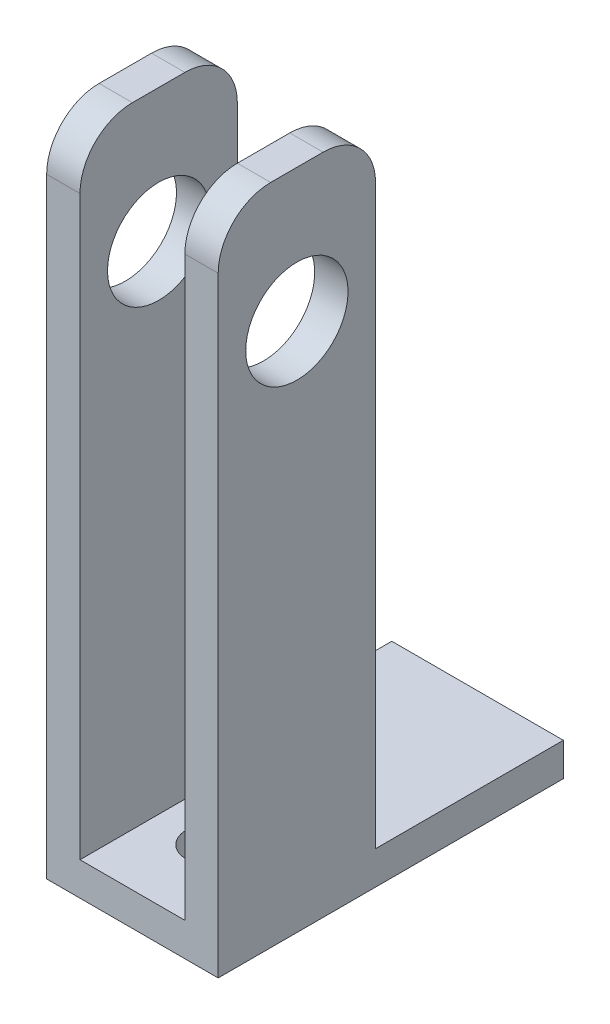
ISO-10303-21;
HEADER;
FILE_DESCRIPTION(('STEP AP214'),'2;1');
FILE_NAME('part.step','',(''),(''),'','','');
FILE_SCHEMA(('AUTOMOTIVE_DESIGN { 1 0 10303 214 1 1 1 1 }'));
ENDSEC;
DATA;
#1=APPLICATION_CONTEXT('core data for automotive mechanical design processes');
#2=APPLICATION_PROTOCOL_DEFINITION('international standard','automotive_design',2000,#1);
#3=PRODUCT_CONTEXT('',#1,'mechanical');
#4=PRODUCT('Part','Part','',(#3));
#5=PRODUCT_RELATED_PRODUCT_CATEGORY('part','',(#4));
#6=PRODUCT_DEFINITION_FORMATION('','',#4);
#7=PRODUCT_DEFINITION_CONTEXT('part definition',#1,'design');
#8=PRODUCT_DEFINITION('design','',#6,#7);
#9=PRODUCT_DEFINITION_SHAPE('','',#8);
#10=(LENGTH_UNIT() NAMED_UNIT(*) SI_UNIT(.MILLI.,.METRE.));
#11=(NAMED_UNIT(*) PLANE_ANGLE_UNIT() SI_UNIT($,.RADIAN.));
#12=(NAMED_UNIT(*) SI_UNIT($,.STERADIAN.) SOLID_ANGLE_UNIT());
#13=UNCERTAINTY_MEASURE_WITH_UNIT(LENGTH_MEASURE(1.E-05),#10,'distance_accuracy_value','');
#14=(GEOMETRIC_REPRESENTATION_CONTEXT(3) GLOBAL_UNCERTAINTY_ASSIGNED_CONTEXT((#13)) GLOBAL_UNIT_ASSIGNED_CONTEXT((#10,
#11,#12)) REPRESENTATION_CONTEXT('',''));
#15=CARTESIAN_POINT('',(0.,0.,0.));
#16=DIRECTION('',(0.,0.,1.));
#17=DIRECTION('',(1.,0.,0.));
#18=AXIS2_PLACEMENT_3D('',#15,#16,#17);
#19=CARTESIAN_POINT('',(-10.,0.,-15.));
#20=DIRECTION('',(0.,0.,-1.));
#21=DIRECTION('',(-1.,0.,0.));
#22=AXIS2_PLACEMENT_3D('',#19,#20,#21);
#23=PLANE('',#22);
#24=DIRECTION('',(0.,1.,0.));
#25=VECTOR('',#24,1.);
#26=CARTESIAN_POINT('',(16.35,0.,-15.));
#27=LINE('',#26,#25);
#28=CARTESIAN_POINT('',(16.35,6.35,-15.));
#29=VERTEX_POINT('',#28);
#30=CARTESIAN_POINT('',(16.35,116.35,-15.));
#31=VERTEX_POINT('',#30);
#32=EDGE_CURVE('E53',#29,#31,#27,.T.);
#33=ORIENTED_EDGE('',*,*,#32,.F.);
#34=DIRECTION('',(-1.,0.,0.));
#35=VECTOR('',#34,1.);
#36=CARTESIAN_POINT('',(-16.35,6.35,-15.));
#37=LINE('',#36,#35);
#38=CARTESIAN_POINT('',(10.,6.35,-15.));
#39=VERTEX_POINT('',#38);
#40=EDGE_CURVE('E152',#29,#39,#37,.T.);
#41=ORIENTED_EDGE('',*,*,#40,.T.);
#42=DIRECTION('',(0.,1.,0.));
#43=VECTOR('',#42,1.);
#44=CARTESIAN_POINT('',(10.,0.,-15.));
#45=LINE('',#44,#43);
#46=CARTESIAN_POINT('',(10.,116.35,-15.));
#47=VERTEX_POINT('',#46);
#48=EDGE_CURVE('E217',#39,#47,#45,.T.);
#49=ORIENTED_EDGE('',*,*,#48,.T.);
#50=DIRECTION('',(-1.,0.,0.));
#51=VECTOR('',#50,1.);
#52=CARTESIAN_POINT('',(-10.,116.35,-15.));
#53=LINE('',#52,#51);
#54=EDGE_CURVE('E249',#47,#31,#53,.F.);
#55=ORIENTED_EDGE('',*,*,#54,.T.);
#56=EDGE_LOOP('',(#33,#41,#49,#55));
#57=FACE_BOUND('',#56,.T.);
#58=ADVANCED_FACE('F38',(#57),#23,.T.);
#59=DIRECTION('',(0.,1.,0.));
#60=VECTOR('',#59,1.);
#61=CARTESIAN_POINT('',(-10.,0.,-15.));
#62=LINE('',#61,#60);
#63=CARTESIAN_POINT('',(-10.,6.35,-15.));
#64=VERTEX_POINT('',#63);
#65=CARTESIAN_POINT('',(-10.,116.35,-15.));
#66=VERTEX_POINT('',#65);
#67=EDGE_CURVE('E204',#64,#66,#62,.T.);
#68=ORIENTED_EDGE('',*,*,#67,.F.);
#69=CARTESIAN_POINT('',(-16.35,6.35,-15.));
#70=VERTEX_POINT('',#69);
#71=EDGE_CURVE('E172',#64,#70,#37,.T.);
#72=ORIENTED_EDGE('',*,*,#71,.T.);
#73=DIRECTION('',(0.,1.,0.));
#74=VECTOR('',#73,1.);
#75=CARTESIAN_POINT('',(-16.35,0.,-15.));
#76=LINE('',#75,#74);
#77=CARTESIAN_POINT('',(-16.35,116.35,-15.));
#78=VERTEX_POINT('',#77);
#79=EDGE_CURVE('E166',#70,#78,#76,.T.);
#80=ORIENTED_EDGE('',*,*,#79,.T.);
#81=DIRECTION('',(-1.,0.,0.));
#82=VECTOR('',#81,1.);
#83=CARTESIAN_POINT('',(-10.,116.35,-15.));
#84=LINE('',#83,#82);
#85=EDGE_CURVE('E247',#78,#66,#84,.F.);
#86=ORIENTED_EDGE('',*,*,#85,.T.);
#87=EDGE_LOOP('',(#68,#72,#80,#86));
#88=FACE_BOUND('',#87,.T.);
#89=ADVANCED_FACE('F274',(#88),#23,.T.);
#90=CARTESIAN_POINT('',(0.,0.,0.));
#91=DIRECTION('',(0.,1.,0.));
#92=DIRECTION('',(0.,0.,1.));
#93=AXIS2_PLACEMENT_3D('',#90,#91,#92);
#94=PLANE('',#93);
#95=CARTESIAN_POINT('',(0.,0.,0.));
#96=DIRECTION('',(0.,1.,0.));
#97=DIRECTION('',(0.,0.,1.));
#98=AXIS2_PLACEMENT_3D('',#95,#96,#97);
#99=CIRCLE('',#98,4.7625);
#100=CARTESIAN_POINT('',(0.,0.,4.7625));
#101=VERTEX_POINT('',#100);
#102=EDGE_CURVE('E176',#101,#101,#99,.T.);
#103=ORIENTED_EDGE('',*,*,#102,.T.);
#104=EDGE_LOOP('',(#103));
#105=FACE_BOUND('',#104,.T.);
#106=DIRECTION('',(1.,0.,0.));
#107=VECTOR('',#106,1.);
#108=CARTESIAN_POINT('',(-10.,0.,15.));
#109=LINE('',#108,#107);
#110=CARTESIAN_POINT('',(-16.35,0.,15.));
#111=VERTEX_POINT('',#110);
#112=CARTESIAN_POINT('',(16.35,0.,15.));
#113=VERTEX_POINT('',#112);
#114=EDGE_CURVE('E228',#111,#113,#109,.T.);
#115=ORIENTED_EDGE('',*,*,#114,.F.);
#116=DIRECTION('',(0.,0.,1.));
#117=VECTOR('',#116,1.);
#118=CARTESIAN_POINT('',(-16.35,0.,-15.));
#119=LINE('',#118,#117);
#120=CARTESIAN_POINT('',(-16.35,0.,-50.8));
#121=VERTEX_POINT('',#120);
#122=EDGE_CURVE('E199',#121,#111,#119,.T.);
#123=ORIENTED_EDGE('',*,*,#122,.F.);
#124=DIRECTION('',(1.,0.,0.));
#125=VECTOR('',#124,1.);
#126=CARTESIAN_POINT('',(-16.35,0.,-50.8));
#127=LINE('',#126,#125);
#128=CARTESIAN_POINT('',(16.35,0.,-50.8));
#129=VERTEX_POINT('',#128);
#130=EDGE_CURVE('E147',#121,#129,#127,.T.);
#131=ORIENTED_EDGE('',*,*,#130,.T.);
#132=DIRECTION('',(0.,0.,-1.));
#133=VECTOR('',#132,1.);
#134=CARTESIAN_POINT('',(16.35,0.,-15.));
#135=LINE('',#134,#133);
#136=EDGE_CURVE('E215',#113,#129,#135,.T.);
#137=ORIENTED_EDGE('',*,*,#136,.F.);
#138=EDGE_LOOP('',(#115,#123,#131,#137));
#139=FACE_BOUND('',#138,.T.);
#140=ADVANCED_FACE('F306',(#105,#139),#94,.F.);
#141=CARTESIAN_POINT('',(-10.,0.,15.));
#142=DIRECTION('',(0.,0.,1.));
#143=DIRECTION('',(1.,0.,0.));
#144=AXIS2_PLACEMENT_3D('',#141,#142,#143);
#145=PLANE('',#144);
#146=DIRECTION('',(0.,1.,0.));
#147=VECTOR('',#146,1.);
#148=CARTESIAN_POINT('',(-10.,0.,15.));
#149=LINE('',#148,#147);
#150=CARTESIAN_POINT('',(-10.,6.35,15.));
#151=VERTEX_POINT('',#150);
#152=CARTESIAN_POINT('',(-10.,116.35,15.));
#153=VERTEX_POINT('',#152);
#154=EDGE_CURVE('E207',#151,#153,#149,.T.);
#155=ORIENTED_EDGE('',*,*,#154,.T.);
#156=DIRECTION('',(1.,0.,0.));
#157=VECTOR('',#156,1.);
#158=CARTESIAN_POINT('',(-10.,116.35,15.));
#159=LINE('',#158,#157);
#160=CARTESIAN_POINT('',(-16.35,116.35,15.));
#161=VERTEX_POINT('',#160);
#162=EDGE_CURVE('E61',#153,#161,#159,.F.);
#163=ORIENTED_EDGE('',*,*,#162,.T.);
#164=DIRECTION('',(0.,1.,0.));
#165=VECTOR('',#164,1.);
#166=CARTESIAN_POINT('',(-16.35,0.,15.));
#167=LINE('',#166,#165);
#168=EDGE_CURVE('E201',#111,#161,#167,.T.);
#169=ORIENTED_EDGE('',*,*,#168,.F.);
#170=ORIENTED_EDGE('',*,*,#114,.T.);
#171=DIRECTION('',(0.,1.,0.));
#172=VECTOR('',#171,1.);
#173=CARTESIAN_POINT('',(16.35,0.,15.));
#174=LINE('',#173,#172);
#175=CARTESIAN_POINT('',(16.35,116.35,15.));
#176=VERTEX_POINT('',#175);
#177=EDGE_CURVE('E220',#113,#176,#174,.T.);
#178=ORIENTED_EDGE('',*,*,#177,.T.);
#179=DIRECTION('',(1.,0.,0.));
#180=VECTOR('',#179,1.);
#181=CARTESIAN_POINT('',(-10.,116.35,15.));
#182=LINE('',#181,#180);
#183=CARTESIAN_POINT('',(10.,116.35,15.));
#184=VERTEX_POINT('',#183);
#185=EDGE_CURVE('E265',#176,#184,#182,.F.);
#186=ORIENTED_EDGE('',*,*,#185,.T.);
#187=DIRECTION('',(0.,1.,0.));
#188=VECTOR('',#187,1.);
#189=CARTESIAN_POINT('',(10.,0.,15.));
#190=LINE('',#189,#188);
#191=CARTESIAN_POINT('',(10.,6.35,15.));
#192=VERTEX_POINT('',#191);
#193=EDGE_CURVE('E223',#192,#184,#190,.T.);
#194=ORIENTED_EDGE('',*,*,#193,.F.);
#195=DIRECTION('',(1.,0.,0.));
#196=VECTOR('',#195,1.);
#197=CARTESIAN_POINT('',(-10.,6.35,15.));
#198=LINE('',#197,#196);
#199=EDGE_CURVE('E234',#151,#192,#198,.T.);
#200=ORIENTED_EDGE('',*,*,#199,.F.);
#201=EDGE_LOOP('',(#155,#163,#169,#170,#178,#186,#194,#200));
#202=FACE_BOUND('',#201,.T.);
#203=ADVANCED_FACE('F280',(#202),#145,.T.);
#204=CARTESIAN_POINT('',(0.,6.35,0.));
#205=DIRECTION('',(0.,1.,0.));
#206=DIRECTION('',(0.,0.,1.));
#207=AXIS2_PLACEMENT_3D('',#204,#205,#206);
#208=PLANE('',#207);
#209=CARTESIAN_POINT('',(0.,6.35,0.));
#210=DIRECTION('',(0.,1.,0.));
#211=DIRECTION('',(0.,0.,1.));
#212=AXIS2_PLACEMENT_3D('',#209,#210,#211);
#213=CIRCLE('',#212,4.7625);
#214=CARTESIAN_POINT('',(0.,6.35,4.7625));
#215=VERTEX_POINT('',#214);
#216=EDGE_CURVE('E174',#215,#215,#213,.T.);
#217=ORIENTED_EDGE('',*,*,#216,.F.);
#218=EDGE_LOOP('',(#217));
#219=FACE_BOUND('',#218,.T.);
#220=ORIENTED_EDGE('',*,*,#199,.T.);
#221=DIRECTION('',(0.,0.,-1.));
#222=VECTOR('',#221,1.);
#223=CARTESIAN_POINT('',(10.,6.35,-15.));
#224=LINE('',#223,#222);
#225=EDGE_CURVE('E231',#192,#39,#224,.T.);
#226=ORIENTED_EDGE('',*,*,#225,.T.);
#227=ORIENTED_EDGE('',*,*,#40,.F.);
#228=DIRECTION('',(0.,0.,1.));
#229=VECTOR('',#228,1.);
#230=CARTESIAN_POINT('',(16.35,6.35,-15.));
#231=LINE('',#230,#229);
#232=CARTESIAN_POINT('',(16.35,6.35,-50.8));
#233=VERTEX_POINT('',#232);
#234=EDGE_CURVE('E162',#233,#29,#231,.T.);
#235=ORIENTED_EDGE('',*,*,#234,.F.);
#236=DIRECTION('',(1.,0.,0.));
#237=VECTOR('',#236,1.);
#238=CARTESIAN_POINT('',(-16.35,6.35,-50.8));
#239=LINE('',#238,#237);
#240=CARTESIAN_POINT('',(-16.35,6.35,-50.8));
#241=VERTEX_POINT('',#240);
#242=EDGE_CURVE('E145',#241,#233,#239,.T.);
#243=ORIENTED_EDGE('',*,*,#242,.F.);
#244=DIRECTION('',(0.,0.,-1.));
#245=VECTOR('',#244,1.);
#246=CARTESIAN_POINT('',(-16.35,6.35,-15.));
#247=LINE('',#246,#245);
#248=EDGE_CURVE('E160',#70,#241,#247,.T.);
#249=ORIENTED_EDGE('',*,*,#248,.F.);
#250=ORIENTED_EDGE('',*,*,#71,.F.);
#251=DIRECTION('',(0.,0.,1.));
#252=VECTOR('',#251,1.);
#253=CARTESIAN_POINT('',(-10.,6.35,-15.));
#254=LINE('',#253,#252);
#255=EDGE_CURVE('E219',#64,#151,#254,.T.);
#256=ORIENTED_EDGE('',*,*,#255,.T.);
#257=EDGE_LOOP('',(#220,#226,#227,#235,#243,#249,#250,#256));
#258=FACE_BOUND('',#257,.T.);
#259=ADVANCED_FACE('F158',(#219,#258),#208,.T.);
#260=CARTESIAN_POINT('',(10.,0.,-15.));
#261=DIRECTION('',(-1.,0.,0.));
#262=DIRECTION('',(0.,0.,1.));
#263=AXIS2_PLACEMENT_3D('',#260,#261,#262);
#264=PLANE('',#263);
#265=CARTESIAN_POINT('',(10.,100.95,0.));
#266=DIRECTION('',(-1.,0.,0.));
#267=DIRECTION('',(0.,0.,1.));
#268=AXIS2_PLACEMENT_3D('',#265,#266,#267);
#269=CIRCLE('',#268,9.74999999999999);
#270=CARTESIAN_POINT('',(10.,100.95,9.74999999999999));
#271=VERTEX_POINT('',#270);
#272=EDGE_CURVE('E190',#271,#271,#269,.T.);
#273=ORIENTED_EDGE('',*,*,#272,.F.);
#274=EDGE_LOOP('',(#273));
#275=FACE_BOUND('',#274,.T.);
#276=DIRECTION('',(0.,0.,1.));
#277=VECTOR('',#276,1.);
#278=CARTESIAN_POINT('',(10.,126.35,-15.));
#279=LINE('',#278,#277);
#280=CARTESIAN_POINT('',(10.,126.35,-5.));
#281=VERTEX_POINT('',#280);
#282=CARTESIAN_POINT('',(10.,126.35,5.));
#283=VERTEX_POINT('',#282);
#284=EDGE_CURVE('E203',#281,#283,#279,.T.);
#285=ORIENTED_EDGE('',*,*,#284,.F.);
#286=CARTESIAN_POINT('',(10.,116.35,-5.));
#287=DIRECTION('',(-1.,0.,0.));
#288=DIRECTION('',(0.,0.,1.));
#289=AXIS2_PLACEMENT_3D('',#286,#287,#288);
#290=CIRCLE('',#289,10.);
#291=EDGE_CURVE('E245',#281,#47,#290,.T.);
#292=ORIENTED_EDGE('',*,*,#291,.T.);
#293=ORIENTED_EDGE('',*,*,#48,.F.);
#294=ORIENTED_EDGE('',*,*,#225,.F.);
#295=ORIENTED_EDGE('',*,*,#193,.T.);
#296=CARTESIAN_POINT('',(10.,116.35,5.));
#297=DIRECTION('',(-1.,0.,0.));
#298=DIRECTION('',(0.,0.,1.));
#299=AXIS2_PLACEMENT_3D('',#296,#297,#298);
#300=CIRCLE('',#299,10.);
#301=EDGE_CURVE('E243',#184,#283,#300,.T.);
#302=ORIENTED_EDGE('',*,*,#301,.T.);
#303=EDGE_LOOP('',(#285,#292,#293,#294,#295,#302));
#304=FACE_BOUND('',#303,.T.);
#305=ADVANCED_FACE('F285',(#275,#304),#264,.T.);
#306=CARTESIAN_POINT('',(16.35,0.,-15.));
#307=DIRECTION('',(1.,0.,0.));
#308=DIRECTION('',(0.,0.,-1.));
#309=AXIS2_PLACEMENT_3D('',#306,#307,#308);
#310=PLANE('',#309);
#311=CARTESIAN_POINT('',(16.35,100.95,0.));
#312=DIRECTION('',(-1.,0.,0.));
#313=DIRECTION('',(0.,0.,1.));
#314=AXIS2_PLACEMENT_3D('',#311,#312,#313);
#315=CIRCLE('',#314,9.74999999999999);
#316=CARTESIAN_POINT('',(16.35,100.95,9.74999999999999));
#317=VERTEX_POINT('',#316);
#318=EDGE_CURVE('E182',#317,#317,#315,.T.);
#319=ORIENTED_EDGE('',*,*,#318,.T.);
#320=EDGE_LOOP('',(#319));
#321=FACE_BOUND('',#320,.T.);
#322=ORIENTED_EDGE('',*,*,#136,.T.);
#323=DIRECTION('',(0.,-1.,0.));
#324=VECTOR('',#323,1.);
#325=CARTESIAN_POINT('',(16.35,6.35,-50.8));
#326=LINE('',#325,#324);
#327=EDGE_CURVE('E151',#233,#129,#326,.T.);
#328=ORIENTED_EDGE('',*,*,#327,.F.);
#329=ORIENTED_EDGE('',*,*,#234,.T.);
#330=ORIENTED_EDGE('',*,*,#32,.T.);
#331=CARTESIAN_POINT('',(16.35,116.35,-5.));
#332=DIRECTION('',(1.,0.,0.));
#333=DIRECTION('',(0.,0.,-1.));
#334=AXIS2_PLACEMENT_3D('',#331,#332,#333);
#335=CIRCLE('',#334,10.);
#336=CARTESIAN_POINT('',(16.35,126.35,-5.));
#337=VERTEX_POINT('',#336);
#338=EDGE_CURVE('E253',#31,#337,#335,.T.);
#339=ORIENTED_EDGE('',*,*,#338,.T.);
#340=DIRECTION('',(0.,0.,-1.));
#341=VECTOR('',#340,1.);
#342=CARTESIAN_POINT('',(16.35,126.35,-15.));
#343=LINE('',#342,#341);
#344=CARTESIAN_POINT('',(16.35,126.35,5.));
#345=VERTEX_POINT('',#344);
#346=EDGE_CURVE('E212',#345,#337,#343,.T.);
#347=ORIENTED_EDGE('',*,*,#346,.F.);
#348=CARTESIAN_POINT('',(16.35,116.35,5.));
#349=DIRECTION('',(1.,0.,0.));
#350=DIRECTION('',(0.,0.,-1.));
#351=AXIS2_PLACEMENT_3D('',#348,#349,#350);
#352=CIRCLE('',#351,10.);
#353=EDGE_CURVE('E251',#345,#176,#352,.T.);
#354=ORIENTED_EDGE('',*,*,#353,.T.);
#355=ORIENTED_EDGE('',*,*,#177,.F.);
#356=EDGE_LOOP('',(#322,#328,#329,#330,#339,#347,#354,#355));
#357=FACE_BOUND('',#356,.T.);
#358=ADVANCED_FACE('F295',(#321,#357),#310,.T.);
#359=CARTESIAN_POINT('',(0.,126.35,0.));
#360=DIRECTION('',(0.,1.,0.));
#361=DIRECTION('',(0.,0.,1.));
#362=AXIS2_PLACEMENT_3D('',#359,#360,#361);
#363=PLANE('',#362);
#364=ORIENTED_EDGE('',*,*,#346,.T.);
#365=DIRECTION('',(-1.,0.,0.));
#366=VECTOR('',#365,1.);
#367=CARTESIAN_POINT('',(0.,126.35,-5.));
#368=LINE('',#367,#366);
#369=EDGE_CURVE('E240',#337,#281,#368,.T.);
#370=ORIENTED_EDGE('',*,*,#369,.T.);
#371=ORIENTED_EDGE('',*,*,#284,.T.);
#372=DIRECTION('',(1.,0.,0.));
#373=VECTOR('',#372,1.);
#374=CARTESIAN_POINT('',(0.,126.35,5.));
#375=LINE('',#374,#373);
#376=EDGE_CURVE('E230',#283,#345,#375,.T.);
#377=ORIENTED_EDGE('',*,*,#376,.T.);
#378=EDGE_LOOP('',(#364,#370,#371,#377));
#379=FACE_BOUND('',#378,.T.);
#380=ADVANCED_FACE('F292',(#379),#363,.T.);
#381=CARTESIAN_POINT('',(-10.,0.,-15.));
#382=DIRECTION('',(1.,0.,0.));
#383=DIRECTION('',(0.,0.,-1.));
#384=AXIS2_PLACEMENT_3D('',#381,#382,#383);
#385=PLANE('',#384);
#386=CARTESIAN_POINT('',(-10.,100.95,0.));
#387=DIRECTION('',(1.,0.,0.));
#388=DIRECTION('',(0.,0.,-1.));
#389=AXIS2_PLACEMENT_3D('',#386,#387,#388);
#390=CIRCLE('',#389,9.74999999999999);
#391=CARTESIAN_POINT('',(-10.,100.95,-9.74999999999998));
#392=VERTEX_POINT('',#391);
#393=EDGE_CURVE('E185',#392,#392,#390,.T.);
#394=ORIENTED_EDGE('',*,*,#393,.F.);
#395=EDGE_LOOP('',(#394));
#396=FACE_BOUND('',#395,.T.);
#397=DIRECTION('',(0.,0.,-1.));
#398=VECTOR('',#397,1.);
#399=CARTESIAN_POINT('',(-10.,126.35,-15.));
#400=LINE('',#399,#398);
#401=CARTESIAN_POINT('',(-10.,126.35,5.));
#402=VERTEX_POINT('',#401);
#403=CARTESIAN_POINT('',(-10.,126.35,-5.));
#404=VERTEX_POINT('',#403);
#405=EDGE_CURVE('E196',#402,#404,#400,.T.);
#406=ORIENTED_EDGE('',*,*,#405,.F.);
#407=CARTESIAN_POINT('',(-10.,116.35,5.));
#408=DIRECTION('',(1.,0.,0.));
#409=DIRECTION('',(0.,0.,-1.));
#410=AXIS2_PLACEMENT_3D('',#407,#408,#409);
#411=CIRCLE('',#410,10.);
#412=EDGE_CURVE('E263',#402,#153,#411,.T.);
#413=ORIENTED_EDGE('',*,*,#412,.T.);
#414=ORIENTED_EDGE('',*,*,#154,.F.);
#415=ORIENTED_EDGE('',*,*,#255,.F.);
#416=ORIENTED_EDGE('',*,*,#67,.T.);
#417=CARTESIAN_POINT('',(-10.,116.35,-5.));
#418=DIRECTION('',(1.,0.,0.));
#419=DIRECTION('',(0.,0.,-1.));
#420=AXIS2_PLACEMENT_3D('',#417,#418,#419);
#421=CIRCLE('',#420,10.);
#422=EDGE_CURVE('E261',#66,#404,#421,.T.);
#423=ORIENTED_EDGE('',*,*,#422,.T.);
#424=EDGE_LOOP('',(#406,#413,#414,#415,#416,#423));
#425=FACE_BOUND('',#424,.T.);
#426=ADVANCED_FACE('F277',(#396,#425),#385,.T.);
#427=CARTESIAN_POINT('',(-16.35,0.,-15.));
#428=DIRECTION('',(-1.,0.,0.));
#429=DIRECTION('',(0.,0.,1.));
#430=AXIS2_PLACEMENT_3D('',#427,#428,#429);
#431=PLANE('',#430);
#432=CARTESIAN_POINT('',(-16.35,100.95,0.));
#433=DIRECTION('',(-1.,0.,0.));
#434=DIRECTION('',(0.,0.,1.));
#435=AXIS2_PLACEMENT_3D('',#432,#433,#434);
#436=CIRCLE('',#435,9.74999999999999);
#437=CARTESIAN_POINT('',(-16.35,100.95,9.74999999999999));
#438=VERTEX_POINT('',#437);
#439=EDGE_CURVE('E179',#438,#438,#436,.T.);
#440=ORIENTED_EDGE('',*,*,#439,.F.);
#441=EDGE_LOOP('',(#440));
#442=FACE_BOUND('',#441,.T.);
#443=ORIENTED_EDGE('',*,*,#168,.T.);
#444=CARTESIAN_POINT('',(-16.35,116.35,5.));
#445=DIRECTION('',(-1.,0.,0.));
#446=DIRECTION('',(0.,0.,1.));
#447=AXIS2_PLACEMENT_3D('',#444,#445,#446);
#448=CIRCLE('',#447,10.);
#449=CARTESIAN_POINT('',(-16.35,126.35,5.));
#450=VERTEX_POINT('',#449);
#451=EDGE_CURVE('E11',#161,#450,#448,.T.);
#452=ORIENTED_EDGE('',*,*,#451,.T.);
#453=DIRECTION('',(0.,0.,1.));
#454=VECTOR('',#453,1.);
#455=CARTESIAN_POINT('',(-16.35,126.35,-15.));
#456=LINE('',#455,#454);
#457=CARTESIAN_POINT('',(-16.35,126.35,-5.));
#458=VERTEX_POINT('',#457);
#459=EDGE_CURVE('E193',#458,#450,#456,.T.);
#460=ORIENTED_EDGE('',*,*,#459,.F.);
#461=CARTESIAN_POINT('',(-16.35,116.35,-5.));
#462=DIRECTION('',(-1.,0.,0.));
#463=DIRECTION('',(0.,0.,1.));
#464=AXIS2_PLACEMENT_3D('',#461,#462,#463);
#465=CIRCLE('',#464,10.);
#466=EDGE_CURVE('E46',#458,#78,#465,.T.);
#467=ORIENTED_EDGE('',*,*,#466,.T.);
#468=ORIENTED_EDGE('',*,*,#79,.F.);
#469=ORIENTED_EDGE('',*,*,#248,.T.);
#470=DIRECTION('',(0.,-1.,0.));
#471=VECTOR('',#470,1.);
#472=CARTESIAN_POINT('',(-16.35,6.35,-50.8));
#473=LINE('',#472,#471);
#474=EDGE_CURVE('E141',#241,#121,#473,.T.);
#475=ORIENTED_EDGE('',*,*,#474,.T.);
#476=ORIENTED_EDGE('',*,*,#122,.T.);
#477=EDGE_LOOP('',(#443,#452,#460,#467,#468,#469,#475,#476));
#478=FACE_BOUND('',#477,.T.);
#479=ADVANCED_FACE('F164',(#442,#478),#431,.T.);
#480=CARTESIAN_POINT('',(0.,126.35,0.));
#481=DIRECTION('',(0.,1.,0.));
#482=DIRECTION('',(0.,0.,1.));
#483=AXIS2_PLACEMENT_3D('',#480,#481,#482);
#484=PLANE('',#483);
#485=ORIENTED_EDGE('',*,*,#459,.T.);
#486=DIRECTION('',(1.,0.,0.));
#487=VECTOR('',#486,1.);
#488=CARTESIAN_POINT('',(0.,126.35,5.));
#489=LINE('',#488,#487);
#490=EDGE_CURVE('E258',#450,#402,#489,.T.);
#491=ORIENTED_EDGE('',*,*,#490,.T.);
#492=ORIENTED_EDGE('',*,*,#405,.T.);
#493=DIRECTION('',(-1.,0.,0.));
#494=VECTOR('',#493,1.);
#495=CARTESIAN_POINT('',(0.,126.35,-5.));
#496=LINE('',#495,#494);
#497=EDGE_CURVE('E255',#404,#458,#496,.T.);
#498=ORIENTED_EDGE('',*,*,#497,.T.);
#499=EDGE_LOOP('',(#485,#491,#492,#498));
#500=FACE_BOUND('',#499,.T.);
#501=ADVANCED_FACE('F342',(#500),#484,.T.);
#502=CARTESIAN_POINT('',(16.35,100.95,0.));
#503=DIRECTION('',(-1.,0.,0.));
#504=DIRECTION('',(0.,0.,1.));
#505=AXIS2_PLACEMENT_3D('',#502,#503,#504);
#506=CYLINDRICAL_SURFACE('',#505,9.74999999999999);
#507=ORIENTED_EDGE('',*,*,#393,.T.);
#508=EDGE_LOOP('',(#507));
#509=FACE_BOUND('',#508,.T.);
#510=ORIENTED_EDGE('',*,*,#439,.T.);
#511=EDGE_LOOP('',(#510));
#512=FACE_BOUND('',#511,.T.);
#513=ADVANCED_FACE('F339',(#509,#512),#506,.F.);
#514=ORIENTED_EDGE('',*,*,#272,.T.);
#515=EDGE_LOOP('',(#514));
#516=FACE_BOUND('',#515,.T.);
#517=ORIENTED_EDGE('',*,*,#318,.F.);
#518=EDGE_LOOP('',(#517));
#519=FACE_BOUND('',#518,.T.);
#520=ADVANCED_FACE('F337',(#516,#519),#506,.F.);
#521=CARTESIAN_POINT('',(0.,0.,0.));
#522=DIRECTION('',(0.,1.,0.));
#523=DIRECTION('',(0.,0.,1.));
#524=AXIS2_PLACEMENT_3D('',#521,#522,#523);
#525=CYLINDRICAL_SURFACE('',#524,4.7625);
#526=ORIENTED_EDGE('',*,*,#102,.F.);
#527=EDGE_LOOP('',(#526));
#528=FACE_BOUND('',#527,.T.);
#529=ORIENTED_EDGE('',*,*,#216,.T.);
#530=EDGE_LOOP('',(#529));
#531=FACE_BOUND('',#530,.T.);
#532=ADVANCED_FACE('F321',(#528,#531),#525,.F.);
#533=CARTESIAN_POINT('',(0.,116.35,-5.));
#534=DIRECTION('',(-1.,0.,0.));
#535=DIRECTION('',(0.,0.,1.));
#536=AXIS2_PLACEMENT_3D('',#533,#534,#535);
#537=CYLINDRICAL_SURFACE('',#536,10.);
#538=ORIENTED_EDGE('',*,*,#338,.F.);
#539=ORIENTED_EDGE('',*,*,#54,.F.);
#540=ORIENTED_EDGE('',*,*,#291,.F.);
#541=ORIENTED_EDGE('',*,*,#369,.F.);
#542=EDGE_LOOP('',(#538,#539,#540,#541));
#543=FACE_BOUND('',#542,.T.);
#544=ADVANCED_FACE('F300',(#543),#537,.T.);
#545=CARTESIAN_POINT('',(0.,116.35,5.));
#546=DIRECTION('',(1.,0.,0.));
#547=DIRECTION('',(0.,0.,-1.));
#548=AXIS2_PLACEMENT_3D('',#545,#546,#547);
#549=CYLINDRICAL_SURFACE('',#548,10.);
#550=ORIENTED_EDGE('',*,*,#451,.F.);
#551=ORIENTED_EDGE('',*,*,#162,.F.);
#552=ORIENTED_EDGE('',*,*,#412,.F.);
#553=ORIENTED_EDGE('',*,*,#490,.F.);
#554=EDGE_LOOP('',(#550,#551,#552,#553));
#555=FACE_BOUND('',#554,.T.);
#556=ADVANCED_FACE('F320',(#555),#549,.T.);
#557=CARTESIAN_POINT('',(0.,116.35,5.));
#558=DIRECTION('',(1.,0.,0.));
#559=DIRECTION('',(0.,0.,-1.));
#560=AXIS2_PLACEMENT_3D('',#557,#558,#559);
#561=CYLINDRICAL_SURFACE('',#560,10.);
#562=ORIENTED_EDGE('',*,*,#301,.F.);
#563=ORIENTED_EDGE('',*,*,#185,.F.);
#564=ORIENTED_EDGE('',*,*,#353,.F.);
#565=ORIENTED_EDGE('',*,*,#376,.F.);
#566=EDGE_LOOP('',(#562,#563,#564,#565));
#567=FACE_BOUND('',#566,.T.);
#568=ADVANCED_FACE('F289',(#567),#561,.T.);
#569=CARTESIAN_POINT('',(0.,116.35,-5.));
#570=DIRECTION('',(-1.,0.,0.));
#571=DIRECTION('',(0.,0.,1.));
#572=AXIS2_PLACEMENT_3D('',#569,#570,#571);
#573=CYLINDRICAL_SURFACE('',#572,10.);
#574=ORIENTED_EDGE('',*,*,#422,.F.);
#575=ORIENTED_EDGE('',*,*,#85,.F.);
#576=ORIENTED_EDGE('',*,*,#466,.F.);
#577=ORIENTED_EDGE('',*,*,#497,.F.);
#578=EDGE_LOOP('',(#574,#575,#576,#577));
#579=FACE_BOUND('',#578,.T.);
#580=ADVANCED_FACE('F40',(#579),#573,.T.);
#581=CARTESIAN_POINT('',(-16.35,6.35,-50.8));
#582=DIRECTION('',(0.,0.,-1.));
#583=DIRECTION('',(-1.,0.,0.));
#584=AXIS2_PLACEMENT_3D('',#581,#582,#583);
#585=PLANE('',#584);
#586=ORIENTED_EDGE('',*,*,#130,.F.);
#587=ORIENTED_EDGE('',*,*,#474,.F.);
#588=ORIENTED_EDGE('',*,*,#242,.T.);
#589=ORIENTED_EDGE('',*,*,#327,.T.);
#590=EDGE_LOOP('',(#586,#587,#588,#589));
#591=FACE_BOUND('',#590,.T.);
#592=ADVANCED_FACE('F143',(#591),#585,.T.);
#593=CLOSED_SHELL('',(#58,#89,#140,#203,#259,#305,#358,#380,#426,#479,#501,#513,#520,#532,#544,
#556,#568,#580,#592));
#594=MANIFOLD_SOLID_BREP('B2',#593);
#595=ADVANCED_BREP_SHAPE_REPRESENTATION('',(#18,#594),#14);
#596=SHAPE_DEFINITION_REPRESENTATION(#9,#595);
ENDSEC;
END-ISO-10303-21;
